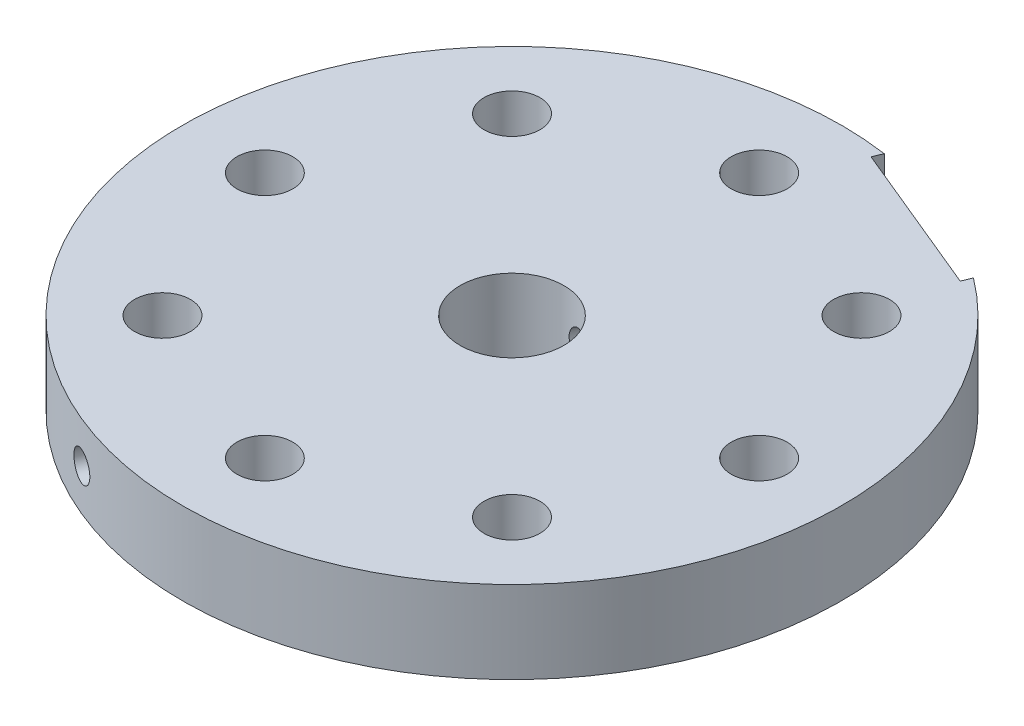
ISO-10303-21;
HEADER;
FILE_DESCRIPTION(('STEP AP214'),'2;1');
FILE_NAME('part.step','',(''),(''),'','','');
FILE_SCHEMA(('AUTOMOTIVE_DESIGN { 1 0 10303 214 1 1 1 1 }'));
ENDSEC;
DATA;
#1=APPLICATION_CONTEXT('core data for automotive mechanical design processes');
#2=APPLICATION_PROTOCOL_DEFINITION('international standard','automotive_design',2000,#1);
#3=PRODUCT_CONTEXT('',#1,'mechanical');
#4=PRODUCT('Part','Part','',(#3));
#5=PRODUCT_RELATED_PRODUCT_CATEGORY('part','',(#4));
#6=PRODUCT_DEFINITION_FORMATION('','',#4);
#7=PRODUCT_DEFINITION_CONTEXT('part definition',#1,'design');
#8=PRODUCT_DEFINITION('design','',#6,#7);
#9=PRODUCT_DEFINITION_SHAPE('','',#8);
#10=(LENGTH_UNIT() NAMED_UNIT(*) SI_UNIT(.MILLI.,.METRE.));
#11=(NAMED_UNIT(*) PLANE_ANGLE_UNIT() SI_UNIT($,.RADIAN.));
#12=(NAMED_UNIT(*) SI_UNIT($,.STERADIAN.) SOLID_ANGLE_UNIT());
#13=UNCERTAINTY_MEASURE_WITH_UNIT(LENGTH_MEASURE(1.E-05),#10,'distance_accuracy_value','');
#14=(GEOMETRIC_REPRESENTATION_CONTEXT(3) GLOBAL_UNCERTAINTY_ASSIGNED_CONTEXT((#13)) GLOBAL_UNIT_ASSIGNED_CONTEXT((#10,
#11,#12)) REPRESENTATION_CONTEXT('',''));
#15=CARTESIAN_POINT('',(0.,0.,0.));
#16=DIRECTION('',(0.,0.,1.));
#17=DIRECTION('',(1.,0.,0.));
#18=AXIS2_PLACEMENT_3D('',#15,#16,#17);
#19=CARTESIAN_POINT('',(-12.7004999999999,3.175,30.6617193489195));
#20=DIRECTION('',(0.382683432365087,0.,-0.923879532511288));
#21=DIRECTION('',(-0.923879532511288,0.,-0.382683432365087));
#22=AXIS2_PLACEMENT_3D('',#19,#20,#21);
#23=CYLINDRICAL_SURFACE('',#22,1.1303);
#24=CARTESIAN_POINT('',(-2.51261003054891,3.175,3.11236097430632));
#25=CARTESIAN_POINT('',(-2.512609281624,3.11288627184608,3.11236227003507));
#26=CARTESIAN_POINT('',(-2.50844713046962,3.05076045537438,3.11573569369836));
#27=CARTESIAN_POINT('',(-2.49189474731856,2.92831328146591,3.12898856780806));
#28=CARTESIAN_POINT('',(-2.47950103830024,2.86799269781913,3.13887076755596));
#29=CARTESIAN_POINT('',(-2.44678774106217,2.7509454970183,3.16443621163922));
#30=CARTESIAN_POINT('',(-2.42648023281556,2.69421355468578,3.18011061262438));
#31=CARTESIAN_POINT('',(-2.37834069869259,2.58569746641614,3.2162708500449));
#32=CARTESIAN_POINT('',(-2.35050783057737,2.5339138751774,3.23675722500306));
#33=CARTESIAN_POINT('',(-2.28700908197914,2.43531054676682,3.28194185131802));
#34=CARTESIAN_POINT('',(-2.25116218694832,2.38865031520022,3.30673387361323));
#35=CARTESIAN_POINT('',(-2.17270248643208,2.30303316811003,3.35880596583536));
#36=CARTESIAN_POINT('',(-2.13008890560757,2.26407713649758,3.3860863207273));
#37=CARTESIAN_POINT('',(-2.03805915188095,2.1942963674395,3.44227677318251));
#38=CARTESIAN_POINT('',(-1.98853352617859,2.16363208888873,3.47120746668675));
#39=CARTESIAN_POINT('',(-1.88439473019335,2.11235496947091,3.5288230135418));
#40=CARTESIAN_POINT('',(-1.8297825301667,2.09174021633006,3.55750791264223));
#41=CARTESIAN_POINT('',(-1.71833301791689,2.06166893679539,3.61263007093561));
#42=CARTESIAN_POINT('',(-1.66158827547536,2.0519406397446,3.63910604222011));
#43=CARTESIAN_POINT('',(-1.54621600026533,2.04306138984324,3.68960405776814));
#44=CARTESIAN_POINT('',(-1.48758882186102,2.04390845771399,3.71362656037285));
#45=CARTESIAN_POINT('',(-1.37189733891681,2.0559686552593,3.75787542001726));
#46=CARTESIAN_POINT('',(-1.31483574041217,2.06688785709415,3.77818994282842));
#47=CARTESIAN_POINT('',(-1.20229005381621,2.09830507425219,3.81549675973698));
#48=CARTESIAN_POINT('',(-1.14680606099122,2.11880366674499,3.8324888535666));
#49=CARTESIAN_POINT('',(-1.03845208201014,2.16901071829332,3.86326629323938));
#50=CARTESIAN_POINT('',(-0.985616695672148,2.19881601574003,3.87701512092383));
#51=CARTESIAN_POINT('',(-0.884742677502026,2.26671509420025,3.9012723395273));
#52=CARTESIAN_POINT('',(-0.836705080888606,2.30481065839132,3.91178003212388));
#53=CARTESIAN_POINT('',(-0.74529792621942,2.38975290161746,3.93023942442285));
#54=CARTESIAN_POINT('',(-0.702145422282221,2.43685525191987,3.9380909166657));
#55=CARTESIAN_POINT('',(-0.623923264343274,2.53767478994262,3.95123997001862));
#56=CARTESIAN_POINT('',(-0.588854236789843,2.59139248984066,3.95653733322505));
#57=CARTESIAN_POINT('',(-0.527859175194727,2.70448679477905,3.96513870647564));
#58=CARTESIAN_POINT('',(-0.502005230161497,2.7639035931072,3.9684271374697));
#59=CARTESIAN_POINT('',(-0.460924096065258,2.88636475664099,3.97340937077598));
#60=CARTESIAN_POINT('',(-0.44569389359521,2.94940808769005,3.97510362532134));
#61=CARTESIAN_POINT('',(-0.426886978953174,3.07508015351299,3.97716665926132));
#62=CARTESIAN_POINT('',(-0.422938672552291,3.13765263615556,3.97757774629245));
#63=CARTESIAN_POINT('',(-0.425814961517306,3.26254140672817,3.97727091930877));
#64=CARTESIAN_POINT('',(-0.432638247206812,3.32485772488067,3.9765531425482));
#65=CARTESIAN_POINT('',(-0.456468531508652,3.44602791427839,3.97388642867277));
#66=CARTESIAN_POINT('',(-0.473245481985388,3.50492797991878,3.97196525016493));
#67=CARTESIAN_POINT('',(-0.516097893978104,3.6191670470457,3.96662402553615));
#68=CARTESIAN_POINT('',(-0.542174676356922,3.67450554136064,3.96320376648374));
#69=CARTESIAN_POINT('',(-0.60339902095553,3.78153525551861,3.95435022957036));
#70=CARTESIAN_POINT('',(-0.638751480870213,3.83310527058119,3.94887008436839));
#71=CARTESIAN_POINT('',(-0.716987627970249,3.92981238941279,3.93541627952946));
#72=CARTESIAN_POINT('',(-0.759872910722812,3.97494812662663,3.92744209133611));
#73=CARTESIAN_POINT('',(-0.853351682794312,4.05903468190825,3.90821413589572));
#74=CARTESIAN_POINT('',(-0.904152529939766,4.09773282843625,3.89686100186355));
#75=CARTESIAN_POINT('',(-1.01074062998016,4.16597604163027,3.87058286257664));
#76=CARTESIAN_POINT('',(-1.0665276203436,4.19552158983551,3.85565804530962));
#77=CARTESIAN_POINT('',(-1.18087387551202,4.24434016934041,3.8221793315347));
#78=CARTESIAN_POINT('',(-1.23940833932827,4.2636909440209,3.80365441982369));
#79=CARTESIAN_POINT('',(-1.35776426157396,4.29178587603908,3.76302876927927));
#80=CARTESIAN_POINT('',(-1.41758539292955,4.30053269723985,3.74092893010003));
#81=CARTESIAN_POINT('',(-1.53455273448799,4.30698774594103,3.69445170239708));
#82=CARTESIAN_POINT('',(-1.59172028230042,4.3050645491379,3.67017852219185));
#83=CARTESIAN_POINT('',(-1.70382485752904,4.29110167770536,3.61949789253735));
#84=CARTESIAN_POINT('',(-1.75876198759398,4.27906246919172,3.593090541475));
#85=CARTESIAN_POINT('',(-1.86450170938277,4.24542745885192,3.53936768685175));
#86=CARTESIAN_POINT('',(-1.91533571487214,4.22391448902643,3.51206191230291));
#87=CARTESIAN_POINT('',(-2.01224876605101,4.17201629426551,3.45744884147324));
#88=CARTESIAN_POINT('',(-2.05832708489781,4.14162971582816,3.43014154559614));
#89=CARTESIAN_POINT('',(-2.1460951150106,4.07181367324253,3.37594663513084));
#90=CARTESIAN_POINT('',(-2.1876171502251,4.03214581882995,3.34909462697521));
#91=CARTESIAN_POINT('',(-2.26392205412202,3.94533467758646,3.29799486502275));
#92=CARTESIAN_POINT('',(-2.29870307120391,3.89818934331393,3.27374782756344));
#93=CARTESIAN_POINT('',(-2.36170436830273,3.79631499909144,3.22860587163358));
#94=CARTESIAN_POINT('',(-2.3897344977883,3.74142311545052,3.20781232842922));
#95=CARTESIAN_POINT('',(-2.43749464166867,3.62649410704049,3.17167502116172));
#96=CARTESIAN_POINT('',(-2.45722943774875,3.56645997051666,3.15632811828412));
#97=CARTESIAN_POINT('',(-2.48585954561106,3.45148306461254,3.13381328584741));
#98=CARTESIAN_POINT('',(-2.49587408489915,3.39697929340256,3.12580950343902));
#99=CARTESIAN_POINT('',(-2.50924916605411,3.28665347135054,3.11508316050973));
#100=CARTESIAN_POINT('',(-2.51261070372843,3.23083161906205,3.11235980962605));
#101=CARTESIAN_POINT('',(-2.51261003054891,3.175,3.11236097430632));
#102=B_SPLINE_CURVE_WITH_KNOTS('',3,(#24,#25,#26,#27,#28,#29,#30,#31,#32,#33,#34,#35,#36,#37,
#38,#39,#40,#41,#42,#43,#44,#45,#46,#47,#48,#49,#50,#51,#52,#53,#54,#55,#56,#57,#58,#59,#60,#61,
#62,#63,#64,#65,#66,#67,#68,#69,#70,#71,#72,#73,#74,#75,#76,#77,#78,#79,#80,#81,#82,#83,#84,#85,
#86,#87,#88,#89,#90,#91,#92,#93,#94,#95,#96,#97,#98,#99,#100,#101),.UNSPECIFIED.,.T.,.F.,(4,2,2,
2,2,2,2,2,2,2,2,2,2,2,2,2,2,2,2,2,2,2,2,2,2,2,2,2,2,2,2,2,2,2,2,2,2,2,4),(0.,0.186135589509667,
0.372349853000609,0.558280977223393,0.7442329194921,0.934908408617395,1.1256057614709,
1.31976512856388,1.51388753560898,1.70304751535098,1.89217209256026,2.07594644403612,
2.2597318695617,2.44549720530416,2.63130253741551,2.82349089718012,3.01569414603704,
3.20936959200038,3.40299007987969,3.59015533205526,3.7772978292814,3.96027493252018,
4.14327803450553,4.3307251999016,4.51821211746173,4.71187415927932,4.90552601036088,
5.09767891516586,5.28978353843415,5.47529451058659,5.66079693541358,5.84470869666107,
6.0286485248508,6.21796564305165,6.40733468878238,6.60153799259507,6.79562919762532,
6.96296430175572,7.13027435762038),.UNSPECIFIED.);
#103=CARTESIAN_POINT('',(-2.51261003054891,3.175,3.11236097430632));
#104=VERTEX_POINT('',#103);
#105=EDGE_CURVE('E225',#104,#104,#102,.T.);
#106=ORIENTED_EDGE('',*,*,#105,.F.);
#107=EDGE_LOOP('',(#106));
#108=FACE_BOUND('',#107,.T.);
#109=CARTESIAN_POINT('',(-10.7547912757703,3.175,23.010746720057));
#110=CARTESIAN_POINT('',(-10.7547888152321,3.11154428572303,23.0107481056329));
#111=CARTESIAN_POINT('',(-10.7499298659162,3.04804336016446,23.0130207911021));
#112=CARTESIAN_POINT('',(-10.7306075850486,2.92279267199952,23.0220366200246));
#113=CARTESIAN_POINT('',(-10.7161328863976,2.8610450722496,23.0287850543953));
#114=CARTESIAN_POINT('',(-10.6779712847525,2.74113358126506,23.0465044912649));
#115=CARTESIAN_POINT('',(-10.6542890163447,2.68296790412211,23.0574733693951));
#116=CARTESIAN_POINT('',(-10.5983569595926,2.57185547223575,23.0832357606584));
#117=CARTESIAN_POINT('',(-10.5661092159958,2.51890747605958,23.0980283609713));
#118=CARTESIAN_POINT('',(-10.4938886912225,2.4196734356901,23.1309288859965));
#119=CARTESIAN_POINT('',(-10.4539103386711,2.37339223842416,23.1490392012554));
#120=CARTESIAN_POINT('',(-10.3673278800822,2.28884677085431,23.1879442897039));
#121=CARTESIAN_POINT('',(-10.3207235058765,2.2505828251796,23.2087391715402));
#122=CARTESIAN_POINT('',(-10.2221455272842,2.18314576166269,23.2523255158231));
#123=CARTESIAN_POINT('',(-10.1701697999514,2.1539762566982,23.2751177671548));
#124=CARTESIAN_POINT('',(-10.062301331182,2.10557932520675,23.3219541572557));
#125=CARTESIAN_POINT('',(-10.0064086148588,2.08635183494437,23.3459982879984));
#126=CARTESIAN_POINT('',(-9.89230578977862,2.05839708821135,23.3945747192634));
#127=CARTESIAN_POINT('',(-9.83409725566898,2.04966281877073,23.419106682592));
#128=CARTESIAN_POINT('',(-9.7169697033013,2.04292081248474,23.4679467625317));
#129=CARTESIAN_POINT('',(-9.65805068974213,2.04491300473675,23.4922548806213));
#130=CARTESIAN_POINT('',(-9.54122152808741,2.05956153134777,23.5399462831131));
#131=CARTESIAN_POINT('',(-9.48331069516789,2.07221031355965,23.5633302101908));
#132=CARTESIAN_POINT('',(-9.37011544485632,2.10780126640307,23.6085716253633));
#133=CARTESIAN_POINT('',(-9.31483103678633,2.13074347356635,23.6304291080403));
#134=CARTESIAN_POINT('',(-9.208466310191,2.18627866172134,23.672080924712));
#135=CARTESIAN_POINT('',(-9.15738750186394,2.21887509031974,23.6918745182539));
#136=CARTESIAN_POINT('',(-9.06094150679307,2.29279090231888,23.7289277538965));
#137=CARTESIAN_POINT('',(-9.01557435152897,2.33411033379296,23.7461873820313));
#138=CARTESIAN_POINT('',(-8.93184386990268,2.42434195456891,23.7778084431828));
#139=CARTESIAN_POINT('',(-8.8934866497628,2.47326069552079,23.7921673505729));
#140=CARTESIAN_POINT('',(-8.82495795393617,2.57727926901481,23.8176711371776));
#141=CARTESIAN_POINT('',(-8.79478648010874,2.63237910296093,23.8288160156621));
#142=CARTESIAN_POINT('',(-8.74352669305143,2.7471996846667,23.8476726453157));
#143=CARTESIAN_POINT('',(-8.72243860200428,2.80692054541615,23.8553843125074));
#144=CARTESIAN_POINT('',(-8.68997886288402,2.92928616420571,23.8672279172763));
#145=CARTESIAN_POINT('',(-8.67860715690323,2.99193090481776,23.8713598761879));
#146=CARTESIAN_POINT('',(-8.66592794612919,3.1183084913902,23.8759657249176));
#147=CARTESIAN_POINT('',(-8.66461181814207,3.1820403580583,23.8764427490381));
#148=CARTESIAN_POINT('',(-8.67206066267753,3.3088336488836,23.8737382694584));
#149=CARTESIAN_POINT('',(-8.68082560890812,3.37189507478891,23.8705567752999));
#150=CARTESIAN_POINT('',(-8.70816724701162,3.49553171207728,23.8605958135345));
#151=CARTESIAN_POINT('',(-8.72674000559532,3.55610790963958,23.853817788262));
#152=CARTESIAN_POINT('',(-8.77313880260896,3.6730849053085,23.8367917874535));
#153=CARTESIAN_POINT('',(-8.80096488328415,3.72948568435118,23.8265437960756));
#154=CARTESIAN_POINT('',(-8.86506448555129,3.83655302182903,23.8027686735994));
#155=CARTESIAN_POINT('',(-8.9013437535423,3.88721564454526,23.7892393115983));
#156=CARTESIAN_POINT('',(-8.98126671463528,3.98132897293775,23.7591806710534));
#157=CARTESIAN_POINT('',(-9.02491044560887,4.0247796415244,23.7426513770824));
#158=CARTESIAN_POINT('',(-9.11831407119365,4.1032663947203,23.7069366519768));
#159=CARTESIAN_POINT('',(-9.16807822977354,4.13829656217561,23.6877493678888));
#160=CARTESIAN_POINT('',(-9.27224538732366,4.19890749128141,23.6471686620194));
#161=CARTESIAN_POINT('',(-9.32664836924906,4.22448828765071,23.625775248344));
#162=CARTESIAN_POINT('',(-9.43849428359038,4.26546396681945,23.5813155455328));
#163=CARTESIAN_POINT('',(-9.49593607305973,4.28086265027694,23.5582498841651));
#164=CARTESIAN_POINT('',(-9.61222438805963,4.30104944210864,23.5110416315598));
#165=CARTESIAN_POINT('',(-9.67107090783984,4.30583759391017,23.4868990447304));
#166=CARTESIAN_POINT('',(-9.78843698046893,4.30466696755908,23.4382280488383));
#167=CARTESIAN_POINT('',(-9.84695677208926,4.29871748074973,23.4136999915295));
#168=CARTESIAN_POINT('',(-9.96206796744311,4.27625964324585,23.364954744031));
#169=CARTESIAN_POINT('',(-10.0186593674733,4.25975127227524,23.3407375544385));
#170=CARTESIAN_POINT('',(-10.1283325272791,4.21664606818796,23.293356385434));
#171=CARTESIAN_POINT('',(-10.1814142476878,4.19004912193354,23.2701924178365));
#172=CARTESIAN_POINT('',(-10.2825981947487,4.12752360711928,23.225658953632));
#173=CARTESIAN_POINT('',(-10.3307005829998,4.09159534153026,23.2042893987935));
#174=CARTESIAN_POINT('',(-10.4206453118764,4.01139465355978,23.1640364666044));
#175=CARTESIAN_POINT('',(-10.4624828860948,3.96711593525852,23.1451549835303));
#176=CARTESIAN_POINT('',(-10.5387257375147,3.87147198536961,23.1105391129873));
#177=CARTESIAN_POINT('',(-10.5731291798108,3.82010500936066,23.0948055025526));
#178=CARTESIAN_POINT('',(-10.633584102337,3.71170890378496,23.0670327599774));
#179=CARTESIAN_POINT('',(-10.6596283942293,3.6546749558748,23.0549968079667));
#180=CARTESIAN_POINT('',(-10.7025969099783,3.53664143162799,23.035081626255));
#181=CARTESIAN_POINT('',(-10.7195319398531,3.47564665063552,23.0271974716477));
#182=CARTESIAN_POINT('',(-10.7393708564165,3.37439234889117,23.0179490850864));
#183=CARTESIAN_POINT('',(-10.7451465025968,3.33478913727434,23.0152524436442));
#184=CARTESIAN_POINT('',(-10.7528574879372,3.25512996071966,23.0116508242145));
#185=CARTESIAN_POINT('',(-10.7547928296665,3.21507399608473,23.0107458450285));
#186=CARTESIAN_POINT('',(-10.7547912757703,3.175,23.010746720057));
#187=B_SPLINE_CURVE_WITH_KNOTS('',3,(#109,#110,#111,#112,#113,#114,#115,#116,#117,#118,#119,
#120,#121,#122,#123,#124,#125,#126,#127,#128,#129,#130,#131,#132,#133,#134,#135,#136,#137,#138,
#139,#140,#141,#142,#143,#144,#145,#146,#147,#148,#149,#150,#151,#152,#153,#154,#155,#156,#157,
#158,#159,#160,#161,#162,#163,#164,#165,#166,#167,#168,#169,#170,#171,#172,#173,#174,#175,#176,
#177,#178,#179,#180,#181,#182,#183,#184,#185,#186),.UNSPECIFIED.,.T.,.F.,(4,2,2,2,2,2,2,2,2,2,2,
2,2,2,2,2,2,2,2,2,2,2,2,2,2,2,2,2,2,2,2,2,2,2,2,2,2,2,4),(0.,0.190220860679565,
0.380666988909374,0.571017380837153,0.761322373156656,0.951765031069185,1.14221539876924,
1.33274132908519,1.52326603797816,1.7136633418812,1.90405938724718,2.09432061550807,
2.28458251901834,2.47491244880571,2.6652434275478,2.85573941789189,3.04623545150552,
3.23673614445438,3.42723570204981,3.61757187776897,3.80790755708176,3.9981669627731,
4.18842723708942,4.37881722789332,4.5692081978042,4.75973256841198,4.95025623898927,
5.14070875295027,5.33116048741628,5.52144750185618,5.71173488170291,5.90202439557934,
6.09230773187617,6.2827351122398,6.47320944066857,6.66384712875891,6.85425816807233,
6.97438785556818,7.09451746269598),.UNSPECIFIED.);
#188=CARTESIAN_POINT('',(-10.7547912757703,3.175,23.010746720057));
#189=VERTEX_POINT('',#188);
#190=EDGE_CURVE('E193',#189,#189,#187,.T.);
#191=ORIENTED_EDGE('',*,*,#190,.T.);
#192=EDGE_LOOP('',(#191));
#193=FACE_BOUND('',#192,.T.);
#194=ADVANCED_FACE('F39',(#108,#193),#23,.F.);
#195=CARTESIAN_POINT('',(0.,6.35,0.));
#196=DIRECTION('',(0.,-1.,0.));
#197=DIRECTION('',(0.,0.,-1.));
#198=AXIS2_PLACEMENT_3D('',#195,#196,#197);
#199=CYLINDRICAL_SURFACE('',#198,25.4);
#200=ORIENTED_EDGE('',*,*,#190,.F.);
#201=EDGE_LOOP('',(#200));
#202=FACE_BOUND('',#201,.T.);
#203=CARTESIAN_POINT('',(0.,0.,0.));
#204=DIRECTION('',(0.,1.,0.));
#205=DIRECTION('',(0.,0.,1.));
#206=AXIS2_PLACEMENT_3D('',#203,#204,#205);
#207=CIRCLE('',#206,25.4);
#208=CARTESIAN_POINT('',(3.54486862721698,0.,-25.1514195705883));
#209=VERTEX_POINT('',#208);
#210=CARTESIAN_POINT('',(15.2781386901103,0.,-20.2913399795517));
#211=VERTEX_POINT('',#210);
#212=EDGE_CURVE('E43',#209,#211,#207,.T.);
#213=ORIENTED_EDGE('',*,*,#212,.T.);
#214=DIRECTION('',(0.,-1.,0.));
#215=VECTOR('',#214,1.);
#216=CARTESIAN_POINT('',(15.2781386901103,6.35,-20.2913399795517));
#217=LINE('',#216,#215);
#218=CARTESIAN_POINT('',(15.2781386901103,6.35,-20.2913399795517));
#219=VERTEX_POINT('',#218);
#220=EDGE_CURVE('E62',#211,#219,#217,.F.);
#221=ORIENTED_EDGE('',*,*,#220,.T.);
#222=CARTESIAN_POINT('',(0.,6.35,0.));
#223=DIRECTION('',(0.,1.,0.));
#224=DIRECTION('',(0.,0.,1.));
#225=AXIS2_PLACEMENT_3D('',#222,#223,#224);
#226=CIRCLE('',#225,25.4);
#227=CARTESIAN_POINT('',(3.54486862721698,6.35,-25.1514195705883));
#228=VERTEX_POINT('',#227);
#229=EDGE_CURVE('E11',#228,#219,#226,.T.);
#230=ORIENTED_EDGE('',*,*,#229,.F.);
#231=DIRECTION('',(0.,-1.,0.));
#232=VECTOR('',#231,1.);
#233=CARTESIAN_POINT('',(3.54486862721698,6.35,-25.1514195705883));
#234=LINE('',#233,#232);
#235=EDGE_CURVE('E111',#228,#209,#234,.T.);
#236=ORIENTED_EDGE('',*,*,#235,.T.);
#237=EDGE_LOOP('',(#213,#221,#230,#236));
#238=FACE_BOUND('',#237,.T.);
#239=ADVANCED_FACE('F41',(#202,#238),#199,.T.);
#240=CARTESIAN_POINT('',(0.,6.35,0.));
#241=DIRECTION('',(0.,1.,0.));
#242=DIRECTION('',(0.,0.,1.));
#243=AXIS2_PLACEMENT_3D('',#240,#241,#242);
#244=PLANE('',#243);
#245=CARTESIAN_POINT('',(0.,6.35,0.));
#246=DIRECTION('',(0.,1.,0.));
#247=DIRECTION('',(0.,0.,1.));
#248=AXIS2_PLACEMENT_3D('',#245,#246,#247);
#249=CIRCLE('',#248,4.);
#250=CARTESIAN_POINT('',(0.,6.35,4.));
#251=VERTEX_POINT('',#250);
#252=EDGE_CURVE('E263',#251,#251,#249,.T.);
#253=ORIENTED_EDGE('',*,*,#252,.F.);
#254=EDGE_LOOP('',(#253));
#255=FACE_BOUND('',#254,.T.);
#256=DIRECTION('',(0.382683432365087,0.,-0.923879532511288));
#257=VECTOR('',#256,1.);
#258=CARTESIAN_POINT('',(14.9792842646403,6.35,-19.5698415724068));
#259=LINE('',#258,#257);
#260=CARTESIAN_POINT('',(14.9792842646403,6.35,-19.5698415724068));
#261=VERTEX_POINT('',#260);
#262=EDGE_CURVE('E106',#261,#219,#259,.T.);
#263=ORIENTED_EDGE('',*,*,#262,.F.);
#264=DIRECTION('',(0.923879532511288,0.,0.382683432365087));
#265=VECTOR('',#264,1.);
#266=CARTESIAN_POINT('',(3.24601420174695,6.35,-24.4299211634434));
#267=LINE('',#266,#265);
#268=CARTESIAN_POINT('',(3.24601420174695,6.35,-24.4299211634434));
#269=VERTEX_POINT('',#268);
#270=EDGE_CURVE('E90',#269,#261,#267,.T.);
#271=ORIENTED_EDGE('',*,*,#270,.F.);
#272=DIRECTION('',(0.382683432365087,0.,-0.923879532511288));
#273=VECTOR('',#272,1.);
#274=CARTESIAN_POINT('',(3.24601420174695,6.35,-24.4299211634434));
#275=LINE('',#274,#273);
#276=EDGE_CURVE('E87',#269,#228,#275,.T.);
#277=ORIENTED_EDGE('',*,*,#276,.T.);
#278=ORIENTED_EDGE('',*,*,#229,.T.);
#279=EDGE_LOOP('',(#263,#271,#277,#278));
#280=FACE_BOUND('',#279,.T.);
#281=CARTESIAN_POINT('',(0.,6.35,-19.05));
#282=DIRECTION('',(0.,1.,0.));
#283=DIRECTION('',(0.,0.,1.));
#284=AXIS2_PLACEMENT_3D('',#281,#282,#283);
#285=CIRCLE('',#284,2.15265);
#286=CARTESIAN_POINT('',(0.,6.35,-16.89735));
#287=VERTEX_POINT('',#286);
#288=EDGE_CURVE('E141',#287,#287,#285,.T.);
#289=ORIENTED_EDGE('',*,*,#288,.F.);
#290=EDGE_LOOP('',(#289));
#291=FACE_BOUND('',#290,.T.);
#292=CARTESIAN_POINT('',(13.4703841816037,6.35,-13.4703841816038));
#293=DIRECTION('',(0.,1.,0.));
#294=DIRECTION('',(0.,0.,1.));
#295=AXIS2_PLACEMENT_3D('',#292,#293,#294);
#296=CIRCLE('',#295,2.15265);
#297=CARTESIAN_POINT('',(13.4703841816037,6.35,-11.3177341816038));
#298=VERTEX_POINT('',#297);
#299=EDGE_CURVE('E151',#298,#298,#296,.T.);
#300=ORIENTED_EDGE('',*,*,#299,.F.);
#301=EDGE_LOOP('',(#300));
#302=FACE_BOUND('',#301,.T.);
#303=CARTESIAN_POINT('',(19.05,6.35,0.));
#304=DIRECTION('',(0.,1.,0.));
#305=DIRECTION('',(0.,0.,1.));
#306=AXIS2_PLACEMENT_3D('',#303,#304,#305);
#307=CIRCLE('',#306,2.15265);
#308=CARTESIAN_POINT('',(19.05,6.35,2.15265));
#309=VERTEX_POINT('',#308);
#310=EDGE_CURVE('E159',#309,#309,#307,.T.);
#311=ORIENTED_EDGE('',*,*,#310,.F.);
#312=EDGE_LOOP('',(#311));
#313=FACE_BOUND('',#312,.T.);
#314=CARTESIAN_POINT('',(13.4703841816038,6.35,13.4703841816037));
#315=DIRECTION('',(0.,1.,0.));
#316=DIRECTION('',(0.,0.,1.));
#317=AXIS2_PLACEMENT_3D('',#314,#315,#316);
#318=CIRCLE('',#317,2.15265);
#319=CARTESIAN_POINT('',(13.4703841816038,6.35,15.6230341816037));
#320=VERTEX_POINT('',#319);
#321=EDGE_CURVE('E126',#320,#320,#318,.T.);
#322=ORIENTED_EDGE('',*,*,#321,.F.);
#323=EDGE_LOOP('',(#322));
#324=FACE_BOUND('',#323,.T.);
#325=CARTESIAN_POINT('',(0.,6.35,19.05));
#326=DIRECTION('',(0.,1.,0.));
#327=DIRECTION('',(0.,0.,1.));
#328=AXIS2_PLACEMENT_3D('',#325,#326,#327);
#329=CIRCLE('',#328,2.15265);
#330=CARTESIAN_POINT('',(0.,6.35,21.20265));
#331=VERTEX_POINT('',#330);
#332=EDGE_CURVE('E117',#331,#331,#329,.T.);
#333=ORIENTED_EDGE('',*,*,#332,.F.);
#334=EDGE_LOOP('',(#333));
#335=FACE_BOUND('',#334,.T.);
#336=CARTESIAN_POINT('',(-13.4703841816037,6.35,13.4703841816038));
#337=DIRECTION('',(0.,1.,0.));
#338=DIRECTION('',(0.,0.,1.));
#339=AXIS2_PLACEMENT_3D('',#336,#337,#338);
#340=CIRCLE('',#339,2.15265000000001);
#341=CARTESIAN_POINT('',(-13.4703841816037,6.35,15.6230341816038));
#342=VERTEX_POINT('',#341);
#343=EDGE_CURVE('E127',#342,#342,#340,.T.);
#344=ORIENTED_EDGE('',*,*,#343,.F.);
#345=EDGE_LOOP('',(#344));
#346=FACE_BOUND('',#345,.T.);
#347=CARTESIAN_POINT('',(-19.05,6.35,0.));
#348=DIRECTION('',(0.,1.,0.));
#349=DIRECTION('',(0.,0.,1.));
#350=AXIS2_PLACEMENT_3D('',#347,#348,#349);
#351=CIRCLE('',#350,2.15265);
#352=CARTESIAN_POINT('',(-19.05,6.35,2.15265));
#353=VERTEX_POINT('',#352);
#354=EDGE_CURVE('E116',#353,#353,#351,.T.);
#355=ORIENTED_EDGE('',*,*,#354,.F.);
#356=EDGE_LOOP('',(#355));
#357=FACE_BOUND('',#356,.T.);
#358=CARTESIAN_POINT('',(-13.4703841816038,6.35,-13.4703841816037));
#359=DIRECTION('',(0.,1.,0.));
#360=DIRECTION('',(0.,0.,1.));
#361=AXIS2_PLACEMENT_3D('',#358,#359,#360);
#362=CIRCLE('',#361,2.15265);
#363=CARTESIAN_POINT('',(-13.4703841816038,6.35,-11.3177341816037));
#364=VERTEX_POINT('',#363);
#365=EDGE_CURVE('E150',#364,#364,#362,.T.);
#366=ORIENTED_EDGE('',*,*,#365,.F.);
#367=EDGE_LOOP('',(#366));
#368=FACE_BOUND('',#367,.T.);
#369=ADVANCED_FACE('F186',(#255,#280,#291,#302,#313,#324,#335,#346,#357,#368),#244,.T.);
#370=CARTESIAN_POINT('',(0.,0.,0.));
#371=DIRECTION('',(0.,1.,0.));
#372=DIRECTION('',(0.,0.,1.));
#373=AXIS2_PLACEMENT_3D('',#370,#371,#372);
#374=PLANE('',#373);
#375=CARTESIAN_POINT('',(0.,0.,0.));
#376=DIRECTION('',(0.,1.,0.));
#377=DIRECTION('',(0.,0.,1.));
#378=AXIS2_PLACEMENT_3D('',#375,#376,#377);
#379=CIRCLE('',#378,4.);
#380=CARTESIAN_POINT('',(0.,0.,4.));
#381=VERTEX_POINT('',#380);
#382=EDGE_CURVE('E231',#381,#381,#379,.F.);
#383=ORIENTED_EDGE('',*,*,#382,.F.);
#384=EDGE_LOOP('',(#383));
#385=FACE_BOUND('',#384,.T.);
#386=CARTESIAN_POINT('',(0.,0.,-19.05));
#387=DIRECTION('',(0.,1.,0.));
#388=DIRECTION('',(0.,0.,1.));
#389=AXIS2_PLACEMENT_3D('',#386,#387,#388);
#390=CIRCLE('',#389,2.15265);
#391=CARTESIAN_POINT('',(0.,0.,-16.89735));
#392=VERTEX_POINT('',#391);
#393=EDGE_CURVE('E145',#392,#392,#390,.F.);
#394=ORIENTED_EDGE('',*,*,#393,.F.);
#395=EDGE_LOOP('',(#394));
#396=FACE_BOUND('',#395,.T.);
#397=CARTESIAN_POINT('',(13.4703841816037,0.,-13.4703841816038));
#398=DIRECTION('',(0.,1.,0.));
#399=DIRECTION('',(0.,0.,1.));
#400=AXIS2_PLACEMENT_3D('',#397,#398,#399);
#401=CIRCLE('',#400,2.15265);
#402=CARTESIAN_POINT('',(13.4703841816037,0.,-11.3177341816038));
#403=VERTEX_POINT('',#402);
#404=EDGE_CURVE('E146',#403,#403,#401,.F.);
#405=ORIENTED_EDGE('',*,*,#404,.F.);
#406=EDGE_LOOP('',(#405));
#407=FACE_BOUND('',#406,.T.);
#408=CARTESIAN_POINT('',(19.05,0.,0.));
#409=DIRECTION('',(0.,1.,0.));
#410=DIRECTION('',(0.,0.,1.));
#411=AXIS2_PLACEMENT_3D('',#408,#409,#410);
#412=CIRCLE('',#411,2.15265);
#413=CARTESIAN_POINT('',(19.05,0.,2.15265));
#414=VERTEX_POINT('',#413);
#415=EDGE_CURVE('E155',#414,#414,#412,.F.);
#416=ORIENTED_EDGE('',*,*,#415,.F.);
#417=EDGE_LOOP('',(#416));
#418=FACE_BOUND('',#417,.T.);
#419=CARTESIAN_POINT('',(13.4703841816038,0.,13.4703841816037));
#420=DIRECTION('',(0.,1.,0.));
#421=DIRECTION('',(0.,0.,1.));
#422=AXIS2_PLACEMENT_3D('',#419,#420,#421);
#423=CIRCLE('',#422,2.15265);
#424=CARTESIAN_POINT('',(13.4703841816038,0.,15.6230341816037));
#425=VERTEX_POINT('',#424);
#426=EDGE_CURVE('E163',#425,#425,#423,.F.);
#427=ORIENTED_EDGE('',*,*,#426,.F.);
#428=EDGE_LOOP('',(#427));
#429=FACE_BOUND('',#428,.T.);
#430=CARTESIAN_POINT('',(0.,0.,19.05));
#431=DIRECTION('',(0.,1.,0.));
#432=DIRECTION('',(0.,0.,1.));
#433=AXIS2_PLACEMENT_3D('',#430,#431,#432);
#434=CIRCLE('',#433,2.15265);
#435=CARTESIAN_POINT('',(0.,0.,21.20265));
#436=VERTEX_POINT('',#435);
#437=EDGE_CURVE('E121',#436,#436,#434,.F.);
#438=ORIENTED_EDGE('',*,*,#437,.F.);
#439=EDGE_LOOP('',(#438));
#440=FACE_BOUND('',#439,.T.);
#441=CARTESIAN_POINT('',(-13.4703841816037,0.,13.4703841816038));
#442=DIRECTION('',(0.,1.,0.));
#443=DIRECTION('',(0.,0.,1.));
#444=AXIS2_PLACEMENT_3D('',#441,#442,#443);
#445=CIRCLE('',#444,2.15265000000001);
#446=CARTESIAN_POINT('',(-13.4703841816037,0.,15.6230341816038));
#447=VERTEX_POINT('',#446);
#448=EDGE_CURVE('E122',#447,#447,#445,.F.);
#449=ORIENTED_EDGE('',*,*,#448,.F.);
#450=EDGE_LOOP('',(#449));
#451=FACE_BOUND('',#450,.T.);
#452=CARTESIAN_POINT('',(-19.05,0.,0.));
#453=DIRECTION('',(0.,1.,0.));
#454=DIRECTION('',(0.,0.,1.));
#455=AXIS2_PLACEMENT_3D('',#452,#453,#454);
#456=CIRCLE('',#455,2.15265);
#457=CARTESIAN_POINT('',(-19.05,0.,2.15265));
#458=VERTEX_POINT('',#457);
#459=EDGE_CURVE('E131',#458,#458,#456,.F.);
#460=ORIENTED_EDGE('',*,*,#459,.F.);
#461=EDGE_LOOP('',(#460));
#462=FACE_BOUND('',#461,.T.);
#463=CARTESIAN_POINT('',(-13.4703841816038,0.,-13.4703841816037));
#464=DIRECTION('',(0.,1.,0.));
#465=DIRECTION('',(0.,0.,1.));
#466=AXIS2_PLACEMENT_3D('',#463,#464,#465);
#467=CIRCLE('',#466,2.15265);
#468=CARTESIAN_POINT('',(-13.4703841816038,0.,-11.3177341816037));
#469=VERTEX_POINT('',#468);
#470=EDGE_CURVE('E176',#469,#469,#467,.F.);
#471=ORIENTED_EDGE('',*,*,#470,.F.);
#472=EDGE_LOOP('',(#471));
#473=FACE_BOUND('',#472,.T.);
#474=DIRECTION('',(-0.923879532511288,0.,-0.382683432365087));
#475=VECTOR('',#474,1.);
#476=CARTESIAN_POINT('',(3.24601420174695,0.,-24.4299211634434));
#477=LINE('',#476,#475);
#478=CARTESIAN_POINT('',(14.9792842646403,0.,-19.5698415724068));
#479=VERTEX_POINT('',#478);
#480=CARTESIAN_POINT('',(3.24601420174695,0.,-24.4299211634434));
#481=VERTEX_POINT('',#480);
#482=EDGE_CURVE('E91',#479,#481,#477,.T.);
#483=ORIENTED_EDGE('',*,*,#482,.F.);
#484=DIRECTION('',(0.382683432365087,0.,-0.923879532511288));
#485=VECTOR('',#484,1.);
#486=CARTESIAN_POINT('',(14.9792842646403,0.,-19.5698415724068));
#487=LINE('',#486,#485);
#488=EDGE_CURVE('E102',#479,#211,#487,.T.);
#489=ORIENTED_EDGE('',*,*,#488,.T.);
#490=ORIENTED_EDGE('',*,*,#212,.F.);
#491=DIRECTION('',(0.382683432365087,0.,-0.923879532511288));
#492=VECTOR('',#491,1.);
#493=CARTESIAN_POINT('',(3.24601420174695,0.,-24.4299211634434));
#494=LINE('',#493,#492);
#495=EDGE_CURVE('E84',#481,#209,#494,.T.);
#496=ORIENTED_EDGE('',*,*,#495,.F.);
#497=EDGE_LOOP('',(#483,#489,#490,#496));
#498=FACE_BOUND('',#497,.T.);
#499=ADVANCED_FACE('F99',(#385,#396,#407,#418,#429,#440,#451,#462,#473,#498),#374,.F.);
#500=CARTESIAN_POINT('',(-13.4703841816038,-0.00100000000000013,-13.4703841816037));
#501=DIRECTION('',(0.,1.,0.));
#502=DIRECTION('',(0.,0.,1.));
#503=AXIS2_PLACEMENT_3D('',#500,#501,#502);
#504=CYLINDRICAL_SURFACE('',#503,2.15265);
#505=ORIENTED_EDGE('',*,*,#365,.T.);
#506=EDGE_LOOP('',(#505));
#507=FACE_BOUND('',#506,.T.);
#508=ORIENTED_EDGE('',*,*,#470,.T.);
#509=EDGE_LOOP('',(#508));
#510=FACE_BOUND('',#509,.T.);
#511=ADVANCED_FACE('F272',(#507,#510),#504,.F.);
#512=CARTESIAN_POINT('',(-19.05,-0.00100000000000013,0.));
#513=DIRECTION('',(0.,1.,0.));
#514=DIRECTION('',(0.,0.,1.));
#515=AXIS2_PLACEMENT_3D('',#512,#513,#514);
#516=CYLINDRICAL_SURFACE('',#515,2.15265);
#517=ORIENTED_EDGE('',*,*,#354,.T.);
#518=EDGE_LOOP('',(#517));
#519=FACE_BOUND('',#518,.T.);
#520=ORIENTED_EDGE('',*,*,#459,.T.);
#521=EDGE_LOOP('',(#520));
#522=FACE_BOUND('',#521,.T.);
#523=ADVANCED_FACE('F277',(#519,#522),#516,.F.);
#524=CARTESIAN_POINT('',(-13.4703841816037,-0.00100000000000013,13.4703841816038));
#525=DIRECTION('',(0.,1.,0.));
#526=DIRECTION('',(0.,0.,1.));
#527=AXIS2_PLACEMENT_3D('',#524,#525,#526);
#528=CYLINDRICAL_SURFACE('',#527,2.15265000000001);
#529=ORIENTED_EDGE('',*,*,#343,.T.);
#530=EDGE_LOOP('',(#529));
#531=FACE_BOUND('',#530,.T.);
#532=ORIENTED_EDGE('',*,*,#448,.T.);
#533=EDGE_LOOP('',(#532));
#534=FACE_BOUND('',#533,.T.);
#535=ADVANCED_FACE('F298',(#531,#534),#528,.F.);
#536=CARTESIAN_POINT('',(0.,-0.00100000000000013,19.05));
#537=DIRECTION('',(0.,1.,0.));
#538=DIRECTION('',(0.,0.,1.));
#539=AXIS2_PLACEMENT_3D('',#536,#537,#538);
#540=CYLINDRICAL_SURFACE('',#539,2.15265);
#541=ORIENTED_EDGE('',*,*,#332,.T.);
#542=EDGE_LOOP('',(#541));
#543=FACE_BOUND('',#542,.T.);
#544=ORIENTED_EDGE('',*,*,#437,.T.);
#545=EDGE_LOOP('',(#544));
#546=FACE_BOUND('',#545,.T.);
#547=ADVANCED_FACE('F283',(#543,#546),#540,.F.);
#548=CARTESIAN_POINT('',(13.4703841816038,-0.00100000000000013,13.4703841816037));
#549=DIRECTION('',(0.,1.,0.));
#550=DIRECTION('',(0.,0.,1.));
#551=AXIS2_PLACEMENT_3D('',#548,#549,#550);
#552=CYLINDRICAL_SURFACE('',#551,2.15265);
#553=ORIENTED_EDGE('',*,*,#321,.T.);
#554=EDGE_LOOP('',(#553));
#555=FACE_BOUND('',#554,.T.);
#556=ORIENTED_EDGE('',*,*,#426,.T.);
#557=EDGE_LOOP('',(#556));
#558=FACE_BOUND('',#557,.T.);
#559=ADVANCED_FACE('F279',(#555,#558),#552,.F.);
#560=CARTESIAN_POINT('',(19.05,-0.00100000000000013,0.));
#561=DIRECTION('',(0.,1.,0.));
#562=DIRECTION('',(0.,0.,1.));
#563=AXIS2_PLACEMENT_3D('',#560,#561,#562);
#564=CYLINDRICAL_SURFACE('',#563,2.15265);
#565=ORIENTED_EDGE('',*,*,#310,.T.);
#566=EDGE_LOOP('',(#565));
#567=FACE_BOUND('',#566,.T.);
#568=ORIENTED_EDGE('',*,*,#415,.T.);
#569=EDGE_LOOP('',(#568));
#570=FACE_BOUND('',#569,.T.);
#571=ADVANCED_FACE('F282',(#567,#570),#564,.F.);
#572=CARTESIAN_POINT('',(13.4703841816037,-0.00100000000000013,-13.4703841816038));
#573=DIRECTION('',(0.,1.,0.));
#574=DIRECTION('',(0.,0.,1.));
#575=AXIS2_PLACEMENT_3D('',#572,#573,#574);
#576=CYLINDRICAL_SURFACE('',#575,2.15265);
#577=ORIENTED_EDGE('',*,*,#299,.T.);
#578=EDGE_LOOP('',(#577));
#579=FACE_BOUND('',#578,.T.);
#580=ORIENTED_EDGE('',*,*,#404,.T.);
#581=EDGE_LOOP('',(#580));
#582=FACE_BOUND('',#581,.T.);
#583=ADVANCED_FACE('F287',(#579,#582),#576,.F.);
#584=CARTESIAN_POINT('',(0.,-0.00100000000000013,-19.05));
#585=DIRECTION('',(0.,1.,0.));
#586=DIRECTION('',(0.,0.,1.));
#587=AXIS2_PLACEMENT_3D('',#584,#585,#586);
#588=CYLINDRICAL_SURFACE('',#587,2.15265);
#589=ORIENTED_EDGE('',*,*,#288,.T.);
#590=EDGE_LOOP('',(#589));
#591=FACE_BOUND('',#590,.T.);
#592=ORIENTED_EDGE('',*,*,#393,.T.);
#593=EDGE_LOOP('',(#592));
#594=FACE_BOUND('',#593,.T.);
#595=ADVANCED_FACE('F291',(#591,#594),#588,.F.);
#596=CARTESIAN_POINT('',(14.9792842646403,6.35,-19.5698415724068));
#597=DIRECTION('',(0.923879532511288,0.,0.382683432365087));
#598=DIRECTION('',(0.382683432365087,0.,-0.923879532511288));
#599=AXIS2_PLACEMENT_3D('',#596,#597,#598);
#600=PLANE('',#599);
#601=ORIENTED_EDGE('',*,*,#488,.F.);
#602=DIRECTION('',(0.,-1.,0.));
#603=VECTOR('',#602,1.);
#604=CARTESIAN_POINT('',(14.9792842646403,6.35,-19.5698415724068));
#605=LINE('',#604,#603);
#606=EDGE_CURVE('E55',#261,#479,#605,.T.);
#607=ORIENTED_EDGE('',*,*,#606,.F.);
#608=ORIENTED_EDGE('',*,*,#262,.T.);
#609=ORIENTED_EDGE('',*,*,#220,.F.);
#610=EDGE_LOOP('',(#601,#607,#608,#609));
#611=FACE_BOUND('',#610,.T.);
#612=ADVANCED_FACE('F191',(#611),#600,.F.);
#613=CARTESIAN_POINT('',(3.24601420174695,0.,-24.4299211634434));
#614=DIRECTION('',(-0.923879532511288,0.,-0.382683432365087));
#615=DIRECTION('',(-0.382683432365087,0.,0.923879532511288));
#616=AXIS2_PLACEMENT_3D('',#613,#614,#615);
#617=PLANE('',#616);
#618=ORIENTED_EDGE('',*,*,#276,.F.);
#619=DIRECTION('',(0.,1.,0.));
#620=VECTOR('',#619,1.);
#621=CARTESIAN_POINT('',(3.24601420174695,0.,-24.4299211634434));
#622=LINE('',#621,#620);
#623=EDGE_CURVE('E81',#481,#269,#622,.T.);
#624=ORIENTED_EDGE('',*,*,#623,.F.);
#625=ORIENTED_EDGE('',*,*,#495,.T.);
#626=ORIENTED_EDGE('',*,*,#235,.F.);
#627=EDGE_LOOP('',(#618,#624,#625,#626));
#628=FACE_BOUND('',#627,.T.);
#629=ADVANCED_FACE('F82',(#628),#617,.F.);
#630=CARTESIAN_POINT('',(9.11264923319363,0.,-21.9998813679251));
#631=DIRECTION('',(-0.382683432365087,0.,0.923879532511288));
#632=DIRECTION('',(0.923879532511288,0.,0.382683432365087));
#633=AXIS2_PLACEMENT_3D('',#630,#631,#632);
#634=PLANE('',#633);
#635=CARTESIAN_POINT('',(9.11264923319364,3.175,-21.9998813679251));
#636=DIRECTION('',(0.382683432365087,0.,-0.923879532511288));
#637=DIRECTION('',(-0.923879532511288,0.,-0.382683432365087));
#638=AXIS2_PLACEMENT_3D('',#635,#636,#637);
#639=CIRCLE('',#638,1.1303);
#640=CARTESIAN_POINT('',(8.06838819759613,3.175,-22.4324284515273));
#641=VERTEX_POINT('',#640);
#642=EDGE_CURVE('E197',#641,#641,#639,.T.);
#643=ORIENTED_EDGE('',*,*,#642,.F.);
#644=EDGE_LOOP('',(#643));
#645=FACE_BOUND('',#644,.T.);
#646=ORIENTED_EDGE('',*,*,#606,.T.);
#647=ORIENTED_EDGE('',*,*,#482,.T.);
#648=ORIENTED_EDGE('',*,*,#623,.T.);
#649=ORIENTED_EDGE('',*,*,#270,.T.);
#650=EDGE_LOOP('',(#646,#647,#648,#649));
#651=FACE_BOUND('',#650,.T.);
#652=ADVANCED_FACE('F94',(#645,#651),#634,.F.);
#653=CARTESIAN_POINT('',(0.424087959353879,3.175,-3.97745514151085));
#654=CARTESIAN_POINT('',(0.424089405142341,3.23711372815392,-3.97745552815955));
#655=CARTESIAN_POINT('',(0.42941786119605,3.29923954462562,-3.97689781360209));
#656=CARTESIAN_POINT('',(0.450493360720144,3.42168671853409,-3.97456470838436));
#657=CARTESIAN_POINT('',(0.466244806865834,3.48200730218087,-3.97278880314823));
#658=CARTESIAN_POINT('',(0.507454100053164,3.5990545029817,-3.96773450771154));
#659=CARTESIAN_POINT('',(0.532897152070983,3.65578644531422,-3.964458406149));
#660=CARTESIAN_POINT('',(0.592506092181862,3.76430253358386,-3.95598776421686));
#661=CARTESIAN_POINT('',(0.62667295662085,3.8160861248226,-3.95079300908756));
#662=CARTESIAN_POINT('',(0.703523708024207,3.91468945323318,-3.93784296902958));
#663=CARTESIAN_POINT('',(0.746401897669254,3.96134968479978,-3.93002599355308));
#664=CARTESIAN_POINT('',(0.838701813474997,4.04696683188997,-3.91136713678901));
#665=CARTESIAN_POINT('',(0.888124289383912,4.08592286350242,-3.90052490875463));
#666=CARTESIAN_POINT('',(0.992931802283955,4.1557036325605,-3.87518269579263));
#667=CARTESIAN_POINT('',(1.04840879762188,4.18636791111127,-3.86061987957726));
#668=CARTESIAN_POINT('',(1.16278639033062,4.23764503052909,-3.82772297463447));
#669=CARTESIAN_POINT('',(1.22168633397654,4.25825978366995,-3.80938960433168));
#670=CARTESIAN_POINT('',(1.33947029177121,4.28833106320461,-3.76956015038279));
#671=CARTESIAN_POINT('',(1.39831622278206,4.2980593602554,-3.74815689703947));
#672=CARTESIAN_POINT('',(1.51560423017447,4.30693861015676,-3.70228386810801));
#673=CARTESIAN_POINT('',(1.57404638007885,4.30609154228602,-3.67781466718936));
#674=CARTESIAN_POINT('',(1.68714128090857,4.2940313447407,-3.62729710378832));
#675=CARTESIAN_POINT('',(1.74185446099289,4.28311214290585,-3.60131299737668));
#676=CARTESIAN_POINT('',(1.84781618239872,4.25169492574781,-3.54811108241191));
#677=CARTESIAN_POINT('',(1.89906451474605,4.23119633325501,-3.52089319961153));
#678=CARTESIAN_POINT('',(1.99744528435231,4.18098928170668,-3.46603830260565));
#679=CARTESIAN_POINT('',(2.04452743360755,4.15118398425997,-3.43839993192849));
#680=CARTESIAN_POINT('',(2.13300857966842,4.08328490579975,-3.3842236734021));
#681=CARTESIAN_POINT('',(2.17440635067534,4.04518934160868,-3.35768602377451));
#682=CARTESIAN_POINT('',(2.25209373106206,3.96024709838253,-3.30610416633014));
#683=CARTESIAN_POINT('',(2.2881590026286,3.91314474808013,-3.28114258157833));
#684=CARTESIAN_POINT('',(2.3527682057383,3.81232521005738,-3.23512894805268));
#685=CARTESIAN_POINT('',(2.38131155437663,3.75860751015934,-3.21407720230571));
#686=CARTESIAN_POINT('',(2.43052366540243,3.64551320522095,-3.17702926998592));
#687=CARTESIAN_POINT('',(2.45113043711121,3.5860964068928,-3.16107304198786));
#688=CARTESIAN_POINT('',(2.48370215656582,3.46363524335901,-3.13554726444591));
#689=CARTESIAN_POINT('',(2.49566955488932,3.40059191230995,-3.12597590387857));
#690=CARTESIAN_POINT('',(2.51042683705468,3.27491984648701,-3.11413619229077));
#691=CARTESIAN_POINT('',(2.51350939371232,3.21234736384444,-3.11163500048788));
#692=CARTESIAN_POINT('',(2.51125859083969,3.08745859327183,-3.11345188447888));
#693=CARTESIAN_POINT('',(2.50592625444389,3.02514227511933,-3.11776913124512));
#694=CARTESIAN_POINT('',(2.48719004735165,2.90397208572162,-3.13273403540775));
#695=CARTESIAN_POINT('',(2.47396847355116,2.84507202008122,-3.14323865250672));
#696=CARTESIAN_POINT('',(2.43989042628606,2.7308329529543,-3.16976306746212));
#697=CARTESIAN_POINT('',(2.4190328682651,2.67549445863936,-3.18578364874433));
#698=CARTESIAN_POINT('',(2.36948032303679,2.56846474448139,-3.22281540199478));
#699=CARTESIAN_POINT('',(2.34060731106529,2.51689472941881,-3.24393831829787));
#700=CARTESIAN_POINT('',(2.27577272428257,2.42018761058721,-3.28974635181185));
#701=CARTESIAN_POINT('',(2.23980964748916,2.37505187337338,-3.31443222351331));
#702=CARTESIAN_POINT('',(2.16011395618015,2.29096531809176,-3.36693547946181));
#703=CARTESIAN_POINT('',(2.11616445461172,2.25226717156375,-3.39482922490651));
#704=CARTESIAN_POINT('',(2.02221383579263,2.18402395836973,-3.45161694275213));
#705=CARTESIAN_POINT('',(1.97221303710717,2.15447841016449,-3.48051086244262));
#706=CARTESIAN_POINT('',(1.86768499913864,2.10565983065959,-3.53769284933985));
#707=CARTESIAN_POINT('',(1.81319579214932,2.0863090559791,-3.5659838749457));
#708=CARTESIAN_POINT('',(1.70077884394573,2.05821412396092,-3.62094747716914));
#709=CARTESIAN_POINT('',(1.64285197015916,2.04946730276015,-3.64762045866216));
#710=CARTESIAN_POINT('',(1.52727920688632,2.04301225405897,-3.69746449617598));
#711=CARTESIAN_POINT('',(1.46969191584026,2.04493545086211,-3.72072432657388));
#712=CARTESIAN_POINT('',(1.35458539359057,2.05889832229464,-3.76415761501657));
#713=CARTESIAN_POINT('',(1.29706615937336,2.07093753080828,-3.78433121521505));
#714=CARTESIAN_POINT('',(1.18430909024693,2.10457254114808,-3.82111269472389));
#715=CARTESIAN_POINT('',(1.12905592190148,2.12608551097358,-3.83774966637126));
#716=CARTESIAN_POINT('',(1.02191077350235,2.17798370573449,-3.86766026932024));
#717=CARTESIAN_POINT('',(0.970019307689536,2.20837028417184,-3.88093338695192));
#718=CARTESIAN_POINT('',(0.869636349729584,2.27818632675747,-3.90467316752025));
#719=CARTESIAN_POINT('',(0.821288600005415,2.31785418117005,-3.91504644313377));
#720=CARTESIAN_POINT('',(0.731199896828516,2.40466532241354,-3.93286916992347));
#721=CARTESIAN_POINT('',(0.689460759182181,2.45181065668607,-3.94031781834747));
#722=CARTESIAN_POINT('',(0.61299193162603,2.55368500090856,-3.95294627959557));
#723=CARTESIAN_POINT('',(0.578468381584549,2.60857688454948,-3.95806331882765));
#724=CARTESIAN_POINT('',(0.519143924953618,2.72350589295951,-3.96628190541323));
#725=CARTESIAN_POINT('',(0.494337417725107,2.78354002948333,-3.96938461445183));
#726=CARTESIAN_POINT('',(0.458172483616287,2.89851693538746,-3.97370876717409));
#727=CARTESIAN_POINT('',(0.445431606159101,2.95302070659744,-3.97513058699905));
#728=CARTESIAN_POINT('',(0.428389325752885,3.06334652864946,-3.97700352776001));
#729=CARTESIAN_POINT('',(0.424086659790753,3.11916838093795,-3.97745479396734));
#730=CARTESIAN_POINT('',(0.424087959353879,3.175,-3.97745514151085));
#731=B_SPLINE_CURVE_WITH_KNOTS('',3,(#653,#654,#655,#656,#657,#658,#659,#660,#661,#662,#663,
#664,#665,#666,#667,#668,#669,#670,#671,#672,#673,#674,#675,#676,#677,#678,#679,#680,#681,#682,
#683,#684,#685,#686,#687,#688,#689,#690,#691,#692,#693,#694,#695,#696,#697,#698,#699,#700,#701,
#702,#703,#704,#705,#706,#707,#708,#709,#710,#711,#712,#713,#714,#715,#716,#717,#718,#719,#720,
#721,#722,#723,#724,#725,#726,#727,#728,#729,#730),.UNSPECIFIED.,.T.,.F.,(4,2,2,2,2,2,2,2,2,2,2,
2,2,2,2,2,2,2,2,2,2,2,2,2,2,2,2,2,2,2,2,2,2,2,2,2,2,2,4),(0.,0.186135589509666,
0.372349853000609,0.558280977223392,0.744232919492098,0.934908408617394,1.12560576147089,
1.31976512856388,1.51388753560898,1.70304751535098,1.89217209256026,2.07594644403612,
2.2597318695617,2.44549720530416,2.63130253741551,2.82349089718012,3.01569414603704,
3.20936959200038,3.40299007987969,3.59015533205526,3.7772978292814,3.96027493252018,
4.14327803450553,4.3307251999016,4.51821211746172,4.71187415927932,4.90552601036088,
5.09767891516586,5.28978353843415,5.47529451058659,5.66079693541358,5.84470869666107,
6.0286485248508,6.21796564305165,6.40733468878238,6.60153799259507,6.79562919762532,
6.96296430175572,7.13027435762038),.UNSPECIFIED.);
#732=CARTESIAN_POINT('',(0.424087959353879,3.175,-3.97745514151085));
#733=VERTEX_POINT('',#732);
#734=EDGE_CURVE('E219',#733,#733,#731,.T.);
#735=ORIENTED_EDGE('',*,*,#734,.F.);
#736=EDGE_LOOP('',(#735));
#737=FACE_BOUND('',#736,.T.);
#738=ORIENTED_EDGE('',*,*,#642,.T.);
#739=EDGE_LOOP('',(#738));
#740=FACE_BOUND('',#739,.T.);
#741=ADVANCED_FACE('F206',(#737,#740),#23,.F.);
#742=CARTESIAN_POINT('',(0.,-0.00100000000000187,0.));
#743=DIRECTION('',(0.,1.,0.));
#744=DIRECTION('',(0.,0.,1.));
#745=AXIS2_PLACEMENT_3D('',#742,#743,#744);
#746=CYLINDRICAL_SURFACE('',#745,4.);
#747=ORIENTED_EDGE('',*,*,#105,.T.);
#748=EDGE_LOOP('',(#747));
#749=FACE_BOUND('',#748,.T.);
#750=ORIENTED_EDGE('',*,*,#734,.T.);
#751=EDGE_LOOP('',(#750));
#752=FACE_BOUND('',#751,.T.);
#753=ORIENTED_EDGE('',*,*,#252,.T.);
#754=EDGE_LOOP('',(#753));
#755=FACE_BOUND('',#754,.T.);
#756=ORIENTED_EDGE('',*,*,#382,.T.);
#757=EDGE_LOOP('',(#756));
#758=FACE_BOUND('',#757,.T.);
#759=ADVANCED_FACE('F211',(#749,#752,#755,#758),#746,.F.);
#760=CLOSED_SHELL('',(#194,#239,#369,#499,#511,#523,#535,#547,#559,#571,#583,#595,#612,#629,
#652,#741,#759));
#761=MANIFOLD_SOLID_BREP('B2',#760);
#762=ADVANCED_BREP_SHAPE_REPRESENTATION('',(#18,#761),#14);
#763=SHAPE_DEFINITION_REPRESENTATION(#9,#762);
ENDSEC;
END-ISO-10303-21;
